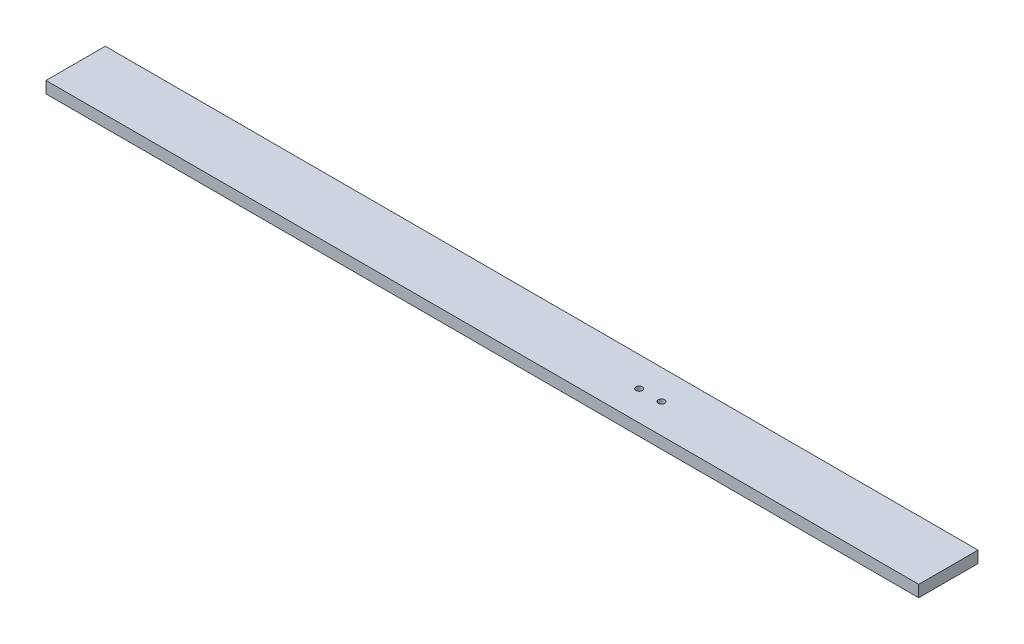
ISO-10303-21;
HEADER;
FILE_DESCRIPTION(('STEP AP214'),'2;1');
FILE_NAME('part.step','',(''),(''),'','','');
FILE_SCHEMA(('AUTOMOTIVE_DESIGN { 1 0 10303 214 1 1 1 1 }'));
ENDSEC;
DATA;
#1=APPLICATION_CONTEXT('core data for automotive mechanical design processes');
#2=APPLICATION_PROTOCOL_DEFINITION('international standard','automotive_design',2000,#1);
#3=PRODUCT_CONTEXT('',#1,'mechanical');
#4=PRODUCT('Part','Part','',(#3));
#5=PRODUCT_RELATED_PRODUCT_CATEGORY('part','',(#4));
#6=PRODUCT_DEFINITION_FORMATION('','',#4);
#7=PRODUCT_DEFINITION_CONTEXT('part definition',#1,'design');
#8=PRODUCT_DEFINITION('design','',#6,#7);
#9=PRODUCT_DEFINITION_SHAPE('','',#8);
#10=(LENGTH_UNIT() NAMED_UNIT(*) SI_UNIT(.MILLI.,.METRE.));
#11=(NAMED_UNIT(*) PLANE_ANGLE_UNIT() SI_UNIT($,.RADIAN.));
#12=(NAMED_UNIT(*) SI_UNIT($,.STERADIAN.) SOLID_ANGLE_UNIT());
#13=UNCERTAINTY_MEASURE_WITH_UNIT(LENGTH_MEASURE(1.E-05),#10,'distance_accuracy_value','');
#14=(GEOMETRIC_REPRESENTATION_CONTEXT(3) GLOBAL_UNCERTAINTY_ASSIGNED_CONTEXT((#13)) GLOBAL_UNIT_ASSIGNED_CONTEXT((#10,
#11,#12)) REPRESENTATION_CONTEXT('',''));
#15=CARTESIAN_POINT('',(0.,0.,0.));
#16=DIRECTION('',(0.,0.,1.));
#17=DIRECTION('',(1.,0.,0.));
#18=AXIS2_PLACEMENT_3D('',#15,#16,#17);
#19=CARTESIAN_POINT('',(374.,10.,-25.4));
#20=DIRECTION('',(-1.,0.,0.));
#21=DIRECTION('',(0.,0.,1.));
#22=AXIS2_PLACEMENT_3D('',#19,#20,#21);
#23=PLANE('',#22);
#24=DIRECTION('',(0.,0.,-1.));
#25=VECTOR('',#24,1.);
#26=CARTESIAN_POINT('',(374.,0.,-25.4));
#27=LINE('',#26,#25);
#28=CARTESIAN_POINT('',(374.,0.,25.4));
#29=VERTEX_POINT('',#28);
#30=CARTESIAN_POINT('',(374.,0.,-25.4));
#31=VERTEX_POINT('',#30);
#32=EDGE_CURVE('E96',#29,#31,#27,.T.);
#33=ORIENTED_EDGE('',*,*,#32,.T.);
#34=DIRECTION('',(0.,-1.,0.));
#35=VECTOR('',#34,1.);
#36=CARTESIAN_POINT('',(374.,10.,-25.4));
#37=LINE('',#36,#35);
#38=CARTESIAN_POINT('',(374.,10.,-25.4));
#39=VERTEX_POINT('',#38);
#40=EDGE_CURVE('E11',#39,#31,#37,.T.);
#41=ORIENTED_EDGE('',*,*,#40,.F.);
#42=DIRECTION('',(0.,0.,-1.));
#43=VECTOR('',#42,1.);
#44=CARTESIAN_POINT('',(374.,10.,-25.4));
#45=LINE('',#44,#43);
#46=CARTESIAN_POINT('',(374.,10.,25.4));
#47=VERTEX_POINT('',#46);
#48=EDGE_CURVE('E84',#47,#39,#45,.T.);
#49=ORIENTED_EDGE('',*,*,#48,.F.);
#50=DIRECTION('',(0.,-1.,0.));
#51=VECTOR('',#50,1.);
#52=CARTESIAN_POINT('',(374.,10.,25.4));
#53=LINE('',#52,#51);
#54=EDGE_CURVE('E92',#47,#29,#53,.T.);
#55=ORIENTED_EDGE('',*,*,#54,.T.);
#56=EDGE_LOOP('',(#33,#41,#49,#55));
#57=FACE_BOUND('',#56,.T.);
#58=ADVANCED_FACE('F33',(#57),#23,.F.);
#59=CARTESIAN_POINT('',(-374.,10.,-25.4));
#60=DIRECTION('',(0.,0.,1.));
#61=DIRECTION('',(1.,0.,0.));
#62=AXIS2_PLACEMENT_3D('',#59,#60,#61);
#63=PLANE('',#62);
#64=DIRECTION('',(-1.,0.,0.));
#65=VECTOR('',#64,1.);
#66=CARTESIAN_POINT('',(-374.,0.,-25.4));
#67=LINE('',#66,#65);
#68=CARTESIAN_POINT('',(-374.,0.,-25.4));
#69=VERTEX_POINT('',#68);
#70=EDGE_CURVE('E88',#31,#69,#67,.T.);
#71=ORIENTED_EDGE('',*,*,#70,.T.);
#72=DIRECTION('',(0.,-1.,0.));
#73=VECTOR('',#72,1.);
#74=CARTESIAN_POINT('',(-374.,10.,-25.4));
#75=LINE('',#74,#73);
#76=CARTESIAN_POINT('',(-374.,10.,-25.4));
#77=VERTEX_POINT('',#76);
#78=EDGE_CURVE('E41',#77,#69,#75,.T.);
#79=ORIENTED_EDGE('',*,*,#78,.F.);
#80=DIRECTION('',(-1.,0.,0.));
#81=VECTOR('',#80,1.);
#82=CARTESIAN_POINT('',(-374.,10.,-25.4));
#83=LINE('',#82,#81);
#84=EDGE_CURVE('E79',#39,#77,#83,.T.);
#85=ORIENTED_EDGE('',*,*,#84,.F.);
#86=ORIENTED_EDGE('',*,*,#40,.T.);
#87=EDGE_LOOP('',(#71,#79,#85,#86));
#88=FACE_BOUND('',#87,.T.);
#89=ADVANCED_FACE('F87',(#88),#63,.F.);
#90=CARTESIAN_POINT('',(-374.,10.,-25.4));
#91=DIRECTION('',(1.,0.,0.));
#92=DIRECTION('',(0.,0.,-1.));
#93=AXIS2_PLACEMENT_3D('',#90,#91,#92);
#94=PLANE('',#93);
#95=DIRECTION('',(0.,0.,1.));
#96=VECTOR('',#95,1.);
#97=CARTESIAN_POINT('',(-374.,0.,-25.4));
#98=LINE('',#97,#96);
#99=CARTESIAN_POINT('',(-374.,0.,25.4));
#100=VERTEX_POINT('',#99);
#101=EDGE_CURVE('E66',#69,#100,#98,.T.);
#102=ORIENTED_EDGE('',*,*,#101,.T.);
#103=DIRECTION('',(0.,-1.,0.));
#104=VECTOR('',#103,1.);
#105=CARTESIAN_POINT('',(-374.,10.,25.4));
#106=LINE('',#105,#104);
#107=CARTESIAN_POINT('',(-374.,10.,25.4));
#108=VERTEX_POINT('',#107);
#109=EDGE_CURVE('E89',#108,#100,#106,.T.);
#110=ORIENTED_EDGE('',*,*,#109,.F.);
#111=DIRECTION('',(0.,0.,1.));
#112=VECTOR('',#111,1.);
#113=CARTESIAN_POINT('',(-374.,10.,-25.4));
#114=LINE('',#113,#112);
#115=EDGE_CURVE('E82',#77,#108,#114,.T.);
#116=ORIENTED_EDGE('',*,*,#115,.F.);
#117=ORIENTED_EDGE('',*,*,#78,.T.);
#118=EDGE_LOOP('',(#102,#110,#116,#117));
#119=FACE_BOUND('',#118,.T.);
#120=ADVANCED_FACE('F90',(#119),#94,.F.);
#121=CARTESIAN_POINT('',(-374.,10.,25.4));
#122=DIRECTION('',(0.,0.,-1.));
#123=DIRECTION('',(-1.,0.,0.));
#124=AXIS2_PLACEMENT_3D('',#121,#122,#123);
#125=PLANE('',#124);
#126=DIRECTION('',(1.,0.,0.));
#127=VECTOR('',#126,1.);
#128=CARTESIAN_POINT('',(-374.,0.,25.4));
#129=LINE('',#128,#127);
#130=EDGE_CURVE('E72',#100,#29,#129,.T.);
#131=ORIENTED_EDGE('',*,*,#130,.T.);
#132=ORIENTED_EDGE('',*,*,#54,.F.);
#133=DIRECTION('',(1.,0.,0.));
#134=VECTOR('',#133,1.);
#135=CARTESIAN_POINT('',(-374.,10.,25.4));
#136=LINE('',#135,#134);
#137=EDGE_CURVE('E49',#108,#47,#136,.T.);
#138=ORIENTED_EDGE('',*,*,#137,.F.);
#139=ORIENTED_EDGE('',*,*,#109,.T.);
#140=EDGE_LOOP('',(#131,#132,#138,#139));
#141=FACE_BOUND('',#140,.T.);
#142=ADVANCED_FACE('F104',(#141),#125,.F.);
#143=CARTESIAN_POINT('',(0.,10.,0.));
#144=DIRECTION('',(0.,1.,0.));
#145=DIRECTION('',(0.,0.,1.));
#146=AXIS2_PLACEMENT_3D('',#143,#144,#145);
#147=PLANE('',#146);
#148=CARTESIAN_POINT('',(128.1,10.,0.));
#149=DIRECTION('',(0.,1.,0.));
#150=DIRECTION('',(0.,0.,1.));
#151=AXIS2_PLACEMENT_3D('',#148,#149,#150);
#152=CIRCLE('',#151,2.75000000000001);
#153=CARTESIAN_POINT('',(128.1,10.,2.75000000000001));
#154=VERTEX_POINT('',#153);
#155=EDGE_CURVE('E116',#154,#154,#152,.T.);
#156=ORIENTED_EDGE('',*,*,#155,.F.);
#157=EDGE_LOOP('',(#156));
#158=FACE_BOUND('',#157,.T.);
#159=CARTESIAN_POINT('',(109.,10.,0.));
#160=DIRECTION('',(0.,1.,0.));
#161=DIRECTION('',(0.,0.,1.));
#162=AXIS2_PLACEMENT_3D('',#159,#160,#161);
#163=CIRCLE('',#162,2.75000000000001);
#164=CARTESIAN_POINT('',(109.,10.,2.75000000000001));
#165=VERTEX_POINT('',#164);
#166=EDGE_CURVE('E110',#165,#165,#163,.T.);
#167=ORIENTED_EDGE('',*,*,#166,.F.);
#168=EDGE_LOOP('',(#167));
#169=FACE_BOUND('',#168,.T.);
#170=ORIENTED_EDGE('',*,*,#48,.T.);
#171=ORIENTED_EDGE('',*,*,#84,.T.);
#172=ORIENTED_EDGE('',*,*,#115,.T.);
#173=ORIENTED_EDGE('',*,*,#137,.T.);
#174=EDGE_LOOP('',(#170,#171,#172,#173));
#175=FACE_BOUND('',#174,.T.);
#176=ADVANCED_FACE('F80',(#158,#169,#175),#147,.T.);
#177=CARTESIAN_POINT('',(0.,0.,0.));
#178=DIRECTION('',(0.,1.,0.));
#179=DIRECTION('',(0.,0.,1.));
#180=AXIS2_PLACEMENT_3D('',#177,#178,#179);
#181=PLANE('',#180);
#182=CARTESIAN_POINT('',(128.1,0.,0.));
#183=DIRECTION('',(0.,1.,0.));
#184=DIRECTION('',(0.,0.,1.));
#185=AXIS2_PLACEMENT_3D('',#182,#183,#184);
#186=CIRCLE('',#185,2.75000000000001);
#187=CARTESIAN_POINT('',(128.1,0.,2.75000000000001));
#188=VERTEX_POINT('',#187);
#189=EDGE_CURVE('E99',#188,#188,#186,.T.);
#190=ORIENTED_EDGE('',*,*,#189,.T.);
#191=EDGE_LOOP('',(#190));
#192=FACE_BOUND('',#191,.T.);
#193=CARTESIAN_POINT('',(109.,0.,0.));
#194=DIRECTION('',(0.,1.,0.));
#195=DIRECTION('',(0.,0.,1.));
#196=AXIS2_PLACEMENT_3D('',#193,#194,#195);
#197=CIRCLE('',#196,2.75000000000001);
#198=CARTESIAN_POINT('',(109.,0.,2.75000000000001));
#199=VERTEX_POINT('',#198);
#200=EDGE_CURVE('E113',#199,#199,#197,.T.);
#201=ORIENTED_EDGE('',*,*,#200,.T.);
#202=EDGE_LOOP('',(#201));
#203=FACE_BOUND('',#202,.T.);
#204=ORIENTED_EDGE('',*,*,#32,.F.);
#205=ORIENTED_EDGE('',*,*,#130,.F.);
#206=ORIENTED_EDGE('',*,*,#101,.F.);
#207=ORIENTED_EDGE('',*,*,#70,.F.);
#208=EDGE_LOOP('',(#204,#205,#206,#207));
#209=FACE_BOUND('',#208,.T.);
#210=ADVANCED_FACE('F107',(#192,#203,#209),#181,.F.);
#211=CARTESIAN_POINT('',(109.,0.,0.));
#212=DIRECTION('',(0.,1.,0.));
#213=DIRECTION('',(0.,0.,1.));
#214=AXIS2_PLACEMENT_3D('',#211,#212,#213);
#215=CYLINDRICAL_SURFACE('',#214,2.75000000000001);
#216=ORIENTED_EDGE('',*,*,#200,.F.);
#217=EDGE_LOOP('',(#216));
#218=FACE_BOUND('',#217,.T.);
#219=ORIENTED_EDGE('',*,*,#166,.T.);
#220=EDGE_LOOP('',(#219));
#221=FACE_BOUND('',#220,.T.);
#222=ADVANCED_FACE('F127',(#218,#221),#215,.F.);
#223=CARTESIAN_POINT('',(128.1,0.,0.));
#224=DIRECTION('',(0.,1.,0.));
#225=DIRECTION('',(0.,0.,1.));
#226=AXIS2_PLACEMENT_3D('',#223,#224,#225);
#227=CYLINDRICAL_SURFACE('',#226,2.75000000000001);
#228=ORIENTED_EDGE('',*,*,#189,.F.);
#229=EDGE_LOOP('',(#228));
#230=FACE_BOUND('',#229,.T.);
#231=ORIENTED_EDGE('',*,*,#155,.T.);
#232=EDGE_LOOP('',(#231));
#233=FACE_BOUND('',#232,.T.);
#234=ADVANCED_FACE('F124',(#230,#233),#227,.F.);
#235=CLOSED_SHELL('',(#58,#89,#120,#142,#176,#210,#222,#234));
#236=MANIFOLD_SOLID_BREP('B2',#235);
#237=ADVANCED_BREP_SHAPE_REPRESENTATION('',(#18,#236),#14);
#238=SHAPE_DEFINITION_REPRESENTATION(#9,#237);
ENDSEC;
END-ISO-10303-21;
